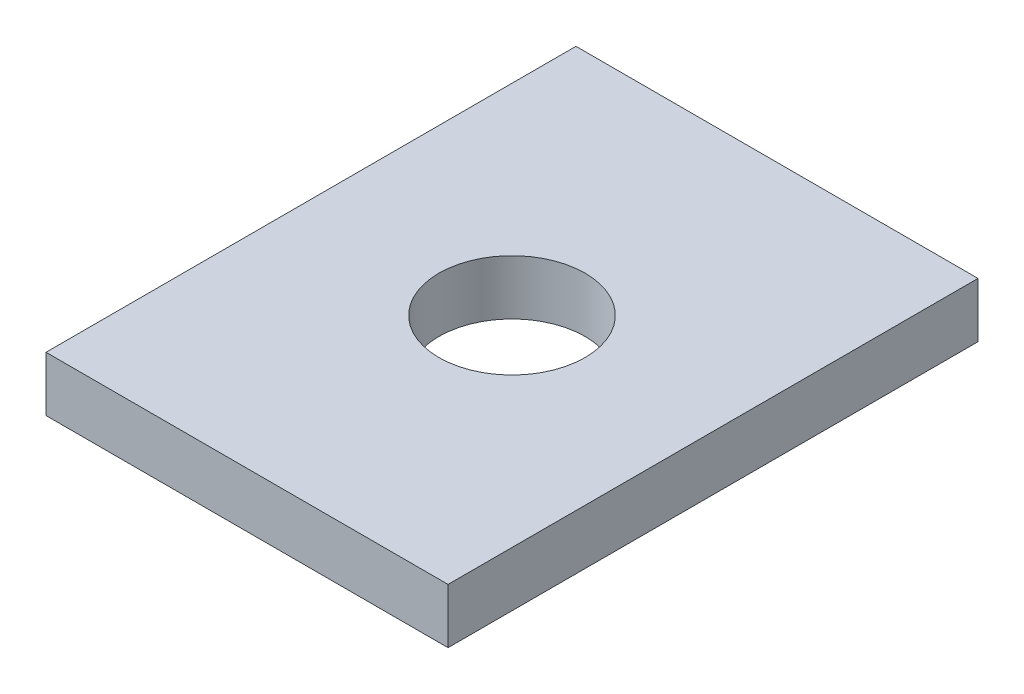
ISO-10303-21;
HEADER;
FILE_DESCRIPTION(('STEP AP214'),'2;1');
FILE_NAME('part.step','',(''),(''),'','','');
FILE_SCHEMA(('AUTOMOTIVE_DESIGN { 1 0 10303 214 1 1 1 1 }'));
ENDSEC;
DATA;
#1=APPLICATION_CONTEXT('core data for automotive mechanical design processes');
#2=APPLICATION_PROTOCOL_DEFINITION('international standard','automotive_design',2000,#1);
#3=PRODUCT_CONTEXT('',#1,'mechanical');
#4=PRODUCT('Part','Part','',(#3));
#5=PRODUCT_RELATED_PRODUCT_CATEGORY('part','',(#4));
#6=PRODUCT_DEFINITION_FORMATION('','',#4);
#7=PRODUCT_DEFINITION_CONTEXT('part definition',#1,'design');
#8=PRODUCT_DEFINITION('design','',#6,#7);
#9=PRODUCT_DEFINITION_SHAPE('','',#8);
#10=(LENGTH_UNIT() NAMED_UNIT(*) SI_UNIT(.MILLI.,.METRE.));
#11=(NAMED_UNIT(*) PLANE_ANGLE_UNIT() SI_UNIT($,.RADIAN.));
#12=(NAMED_UNIT(*) SI_UNIT($,.STERADIAN.) SOLID_ANGLE_UNIT());
#13=UNCERTAINTY_MEASURE_WITH_UNIT(LENGTH_MEASURE(1.E-05),#10,'distance_accuracy_value','');
#14=(GEOMETRIC_REPRESENTATION_CONTEXT(3) GLOBAL_UNCERTAINTY_ASSIGNED_CONTEXT((#13)) GLOBAL_UNIT_ASSIGNED_CONTEXT((#10,
#11,#12)) REPRESENTATION_CONTEXT('',''));
#15=CARTESIAN_POINT('',(0.,0.,0.));
#16=DIRECTION('',(0.,0.,1.));
#17=DIRECTION('',(1.,0.,0.));
#18=AXIS2_PLACEMENT_3D('',#15,#16,#17);
#19=CARTESIAN_POINT('',(0.,19.05,0.));
#20=DIRECTION('',(0.,-1.,0.));
#21=DIRECTION('',(0.,0.,-1.));
#22=AXIS2_PLACEMENT_3D('',#19,#20,#21);
#23=PLANE('',#22);
#24=DIRECTION('',(0.,0.,-1.));
#25=VECTOR('',#24,1.);
#26=CARTESIAN_POINT('',(69.85,19.05,92.075));
#27=LINE('',#26,#25);
#28=CARTESIAN_POINT('',(69.85,19.05,92.075));
#29=VERTEX_POINT('',#28);
#30=CARTESIAN_POINT('',(69.85,19.05,-92.075));
#31=VERTEX_POINT('',#30);
#32=EDGE_CURVE('E91',#29,#31,#27,.T.);
#33=ORIENTED_EDGE('',*,*,#32,.T.);
#34=DIRECTION('',(-1.,0.,0.));
#35=VECTOR('',#34,1.);
#36=CARTESIAN_POINT('',(-69.85,19.05,-92.075));
#37=LINE('',#36,#35);
#38=CARTESIAN_POINT('',(-69.85,19.05,-92.075));
#39=VERTEX_POINT('',#38);
#40=EDGE_CURVE('E86',#31,#39,#37,.T.);
#41=ORIENTED_EDGE('',*,*,#40,.T.);
#42=DIRECTION('',(0.,0.,1.));
#43=VECTOR('',#42,1.);
#44=CARTESIAN_POINT('',(-69.85,19.05,92.075));
#45=LINE('',#44,#43);
#46=CARTESIAN_POINT('',(-69.85,19.05,92.075));
#47=VERTEX_POINT('',#46);
#48=EDGE_CURVE('E89',#39,#47,#45,.T.);
#49=ORIENTED_EDGE('',*,*,#48,.T.);
#50=DIRECTION('',(1.,0.,0.));
#51=VECTOR('',#50,1.);
#52=CARTESIAN_POINT('',(-69.85,19.05,92.075));
#53=LINE('',#52,#51);
#54=EDGE_CURVE('E56',#47,#29,#53,.T.);
#55=ORIENTED_EDGE('',*,*,#54,.T.);
#56=EDGE_LOOP('',(#33,#41,#49,#55));
#57=FACE_BOUND('',#56,.T.);
#58=CARTESIAN_POINT('',(0.,19.05,0.));
#59=DIRECTION('',(0.,1.,0.));
#60=DIRECTION('',(0.,0.,1.));
#61=AXIS2_PLACEMENT_3D('',#58,#59,#60);
#62=CIRCLE('',#61,25.4);
#63=CARTESIAN_POINT('',(0.,19.05,25.4));
#64=VERTEX_POINT('',#63);
#65=EDGE_CURVE('E106',#64,#64,#62,.T.);
#66=ORIENTED_EDGE('',*,*,#65,.F.);
#67=EDGE_LOOP('',(#66));
#68=FACE_BOUND('',#67,.T.);
#69=ADVANCED_FACE('F39',(#57,#68),#23,.F.);
#70=CARTESIAN_POINT('',(0.,0.,0.));
#71=DIRECTION('',(0.,-1.,0.));
#72=DIRECTION('',(0.,0.,-1.));
#73=AXIS2_PLACEMENT_3D('',#70,#71,#72);
#74=PLANE('',#73);
#75=DIRECTION('',(0.,0.,-1.));
#76=VECTOR('',#75,1.);
#77=CARTESIAN_POINT('',(69.85,0.,92.075));
#78=LINE('',#77,#76);
#79=CARTESIAN_POINT('',(69.85,0.,92.075));
#80=VERTEX_POINT('',#79);
#81=CARTESIAN_POINT('',(69.85,0.,-92.075));
#82=VERTEX_POINT('',#81);
#83=EDGE_CURVE('E103',#80,#82,#78,.T.);
#84=ORIENTED_EDGE('',*,*,#83,.F.);
#85=DIRECTION('',(1.,0.,0.));
#86=VECTOR('',#85,1.);
#87=CARTESIAN_POINT('',(-69.85,0.,92.075));
#88=LINE('',#87,#86);
#89=CARTESIAN_POINT('',(-69.85,0.,92.075));
#90=VERTEX_POINT('',#89);
#91=EDGE_CURVE('E79',#90,#80,#88,.T.);
#92=ORIENTED_EDGE('',*,*,#91,.F.);
#93=DIRECTION('',(0.,0.,1.));
#94=VECTOR('',#93,1.);
#95=CARTESIAN_POINT('',(-69.85,0.,92.075));
#96=LINE('',#95,#94);
#97=CARTESIAN_POINT('',(-69.85,0.,-92.075));
#98=VERTEX_POINT('',#97);
#99=EDGE_CURVE('E73',#98,#90,#96,.T.);
#100=ORIENTED_EDGE('',*,*,#99,.F.);
#101=DIRECTION('',(-1.,0.,0.));
#102=VECTOR('',#101,1.);
#103=CARTESIAN_POINT('',(-69.85,0.,-92.075));
#104=LINE('',#103,#102);
#105=EDGE_CURVE('E95',#82,#98,#104,.T.);
#106=ORIENTED_EDGE('',*,*,#105,.F.);
#107=EDGE_LOOP('',(#84,#92,#100,#106));
#108=FACE_BOUND('',#107,.T.);
#109=CARTESIAN_POINT('',(0.,0.,0.));
#110=DIRECTION('',(0.,1.,0.));
#111=DIRECTION('',(0.,0.,1.));
#112=AXIS2_PLACEMENT_3D('',#109,#110,#111);
#113=CIRCLE('',#112,25.4);
#114=CARTESIAN_POINT('',(0.,0.,25.4));
#115=VERTEX_POINT('',#114);
#116=EDGE_CURVE('E118',#115,#115,#113,.T.);
#117=ORIENTED_EDGE('',*,*,#116,.T.);
#118=EDGE_LOOP('',(#117));
#119=FACE_BOUND('',#118,.T.);
#120=ADVANCED_FACE('F114',(#108,#119),#74,.T.);
#121=CARTESIAN_POINT('',(69.85,19.05,92.075));
#122=DIRECTION('',(-1.,0.,0.));
#123=DIRECTION('',(0.,0.,1.));
#124=AXIS2_PLACEMENT_3D('',#121,#122,#123);
#125=PLANE('',#124);
#126=ORIENTED_EDGE('',*,*,#83,.T.);
#127=DIRECTION('',(0.,-1.,0.));
#128=VECTOR('',#127,1.);
#129=CARTESIAN_POINT('',(69.85,19.05,-92.075));
#130=LINE('',#129,#128);
#131=EDGE_CURVE('E11',#31,#82,#130,.T.);
#132=ORIENTED_EDGE('',*,*,#131,.F.);
#133=ORIENTED_EDGE('',*,*,#32,.F.);
#134=DIRECTION('',(0.,-1.,0.));
#135=VECTOR('',#134,1.);
#136=CARTESIAN_POINT('',(69.85,19.05,92.075));
#137=LINE('',#136,#135);
#138=EDGE_CURVE('E99',#29,#80,#137,.T.);
#139=ORIENTED_EDGE('',*,*,#138,.T.);
#140=EDGE_LOOP('',(#126,#132,#133,#139));
#141=FACE_BOUND('',#140,.T.);
#142=ADVANCED_FACE('F41',(#141),#125,.F.);
#143=CARTESIAN_POINT('',(-69.85,19.05,-92.075));
#144=DIRECTION('',(0.,0.,1.));
#145=DIRECTION('',(1.,0.,0.));
#146=AXIS2_PLACEMENT_3D('',#143,#144,#145);
#147=PLANE('',#146);
#148=ORIENTED_EDGE('',*,*,#105,.T.);
#149=DIRECTION('',(0.,-1.,0.));
#150=VECTOR('',#149,1.);
#151=CARTESIAN_POINT('',(-69.85,19.05,-92.075));
#152=LINE('',#151,#150);
#153=EDGE_CURVE('E48',#39,#98,#152,.T.);
#154=ORIENTED_EDGE('',*,*,#153,.F.);
#155=ORIENTED_EDGE('',*,*,#40,.F.);
#156=ORIENTED_EDGE('',*,*,#131,.T.);
#157=EDGE_LOOP('',(#148,#154,#155,#156));
#158=FACE_BOUND('',#157,.T.);
#159=ADVANCED_FACE('F94',(#158),#147,.F.);
#160=CARTESIAN_POINT('',(-69.85,19.05,92.075));
#161=DIRECTION('',(1.,0.,0.));
#162=DIRECTION('',(0.,0.,-1.));
#163=AXIS2_PLACEMENT_3D('',#160,#161,#162);
#164=PLANE('',#163);
#165=ORIENTED_EDGE('',*,*,#99,.T.);
#166=DIRECTION('',(0.,-1.,0.));
#167=VECTOR('',#166,1.);
#168=CARTESIAN_POINT('',(-69.85,19.05,92.075));
#169=LINE('',#168,#167);
#170=EDGE_CURVE('E96',#47,#90,#169,.T.);
#171=ORIENTED_EDGE('',*,*,#170,.F.);
#172=ORIENTED_EDGE('',*,*,#48,.F.);
#173=ORIENTED_EDGE('',*,*,#153,.T.);
#174=EDGE_LOOP('',(#165,#171,#172,#173));
#175=FACE_BOUND('',#174,.T.);
#176=ADVANCED_FACE('F97',(#175),#164,.F.);
#177=CARTESIAN_POINT('',(-69.85,19.05,92.075));
#178=DIRECTION('',(0.,0.,-1.));
#179=DIRECTION('',(-1.,0.,0.));
#180=AXIS2_PLACEMENT_3D('',#177,#178,#179);
#181=PLANE('',#180);
#182=ORIENTED_EDGE('',*,*,#91,.T.);
#183=ORIENTED_EDGE('',*,*,#138,.F.);
#184=ORIENTED_EDGE('',*,*,#54,.F.);
#185=ORIENTED_EDGE('',*,*,#170,.T.);
#186=EDGE_LOOP('',(#182,#183,#184,#185));
#187=FACE_BOUND('',#186,.T.);
#188=ADVANCED_FACE('F111',(#187),#181,.F.);
#189=CARTESIAN_POINT('',(0.,19.05,0.));
#190=DIRECTION('',(0.,-1.,0.));
#191=DIRECTION('',(0.,0.,-1.));
#192=AXIS2_PLACEMENT_3D('',#189,#190,#191);
#193=CYLINDRICAL_SURFACE('',#192,25.4);
#194=ORIENTED_EDGE('',*,*,#65,.T.);
#195=EDGE_LOOP('',(#194));
#196=FACE_BOUND('',#195,.T.);
#197=ORIENTED_EDGE('',*,*,#116,.F.);
#198=EDGE_LOOP('',(#197));
#199=FACE_BOUND('',#198,.T.);
#200=ADVANCED_FACE('F124',(#196,#199),#193,.F.);
#201=CLOSED_SHELL('',(#69,#120,#142,#159,#176,#188,#200));
#202=MANIFOLD_SOLID_BREP('B2',#201);
#203=ADVANCED_BREP_SHAPE_REPRESENTATION('',(#18,#202),#14);
#204=SHAPE_DEFINITION_REPRESENTATION(#9,#203);
ENDSEC;
END-ISO-10303-21;
